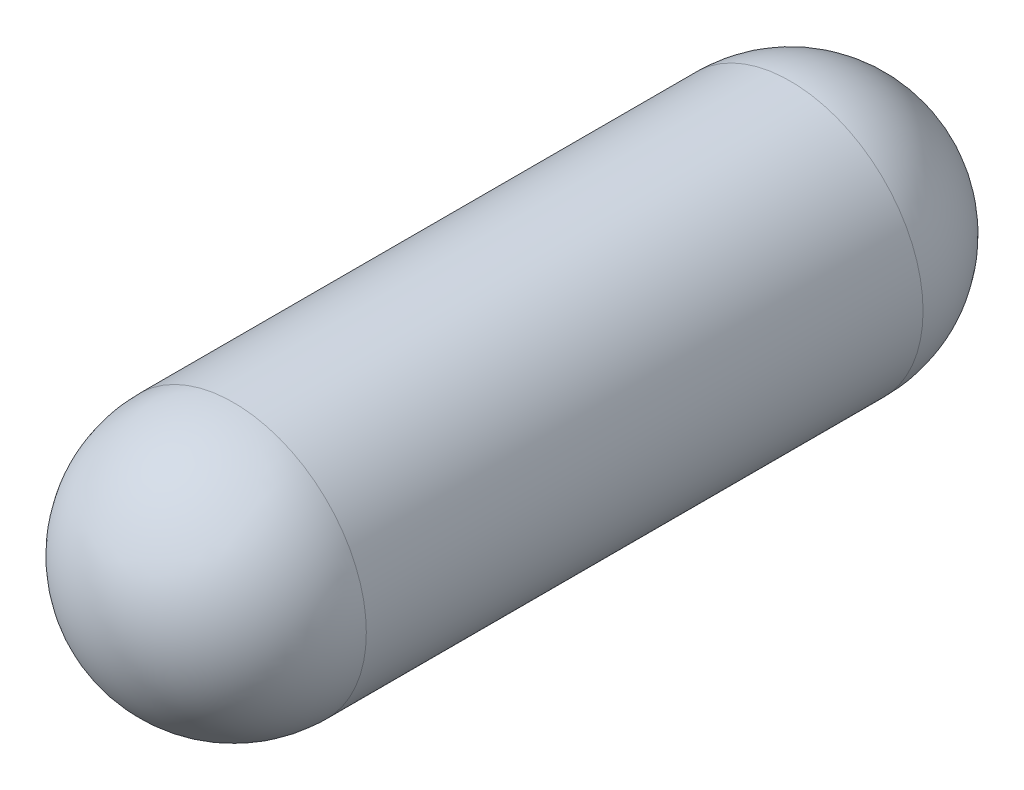
ISO-10303-21;
HEADER;
FILE_DESCRIPTION(('STEP AP214'),'2;1');
FILE_NAME('part.step','',(''),(''),'','','');
FILE_SCHEMA(('AUTOMOTIVE_DESIGN { 1 0 10303 214 1 1 1 1 }'));
ENDSEC;
DATA;
#1=APPLICATION_CONTEXT('core data for automotive mechanical design processes');
#2=APPLICATION_PROTOCOL_DEFINITION('international standard','automotive_design',2000,#1);
#3=PRODUCT_CONTEXT('',#1,'mechanical');
#4=PRODUCT('Part','Part','',(#3));
#5=PRODUCT_RELATED_PRODUCT_CATEGORY('part','',(#4));
#6=PRODUCT_DEFINITION_FORMATION('','',#4);
#7=PRODUCT_DEFINITION_CONTEXT('part definition',#1,'design');
#8=PRODUCT_DEFINITION('design','',#6,#7);
#9=PRODUCT_DEFINITION_SHAPE('','',#8);
#10=(LENGTH_UNIT() NAMED_UNIT(*) SI_UNIT(.MILLI.,.METRE.));
#11=(NAMED_UNIT(*) PLANE_ANGLE_UNIT() SI_UNIT($,.RADIAN.));
#12=(NAMED_UNIT(*) SI_UNIT($,.STERADIAN.) SOLID_ANGLE_UNIT());
#13=UNCERTAINTY_MEASURE_WITH_UNIT(LENGTH_MEASURE(1.E-05),#10,'distance_accuracy_value','');
#14=(GEOMETRIC_REPRESENTATION_CONTEXT(3) GLOBAL_UNCERTAINTY_ASSIGNED_CONTEXT((#13)) GLOBAL_UNIT_ASSIGNED_CONTEXT((#10,
#11,#12)) REPRESENTATION_CONTEXT('',''));
#15=CARTESIAN_POINT('',(0.,0.,0.));
#16=DIRECTION('',(0.,0.,1.));
#17=DIRECTION('',(1.,0.,0.));
#18=AXIS2_PLACEMENT_3D('',#15,#16,#17);
#19=CARTESIAN_POINT('',(0.,0.,-3.));
#20=DIRECTION('',(1.,0.,0.));
#21=DIRECTION('',(0.,-1.,0.));
#22=AXIS2_PLACEMENT_3D('',#19,#20,#21);
#23=SPHERICAL_SURFACE('',#22,1.55);
#24=CARTESIAN_POINT('',(0.,0.,-3.));
#25=DIRECTION('',(0.,0.,1.));
#26=DIRECTION('',(1.,0.,0.));
#27=AXIS2_PLACEMENT_3D('',#24,#25,#26);
#28=CIRCLE('',#27,1.55);
#29=CARTESIAN_POINT('',(1.55,0.,-3.));
#30=VERTEX_POINT('',#29);
#31=CARTESIAN_POINT('',(-1.55,0.,-3.));
#32=VERTEX_POINT('',#31);
#33=EDGE_CURVE('E41',#30,#32,#28,.T.);
#34=ORIENTED_EDGE('',*,*,#33,.F.);
#35=CARTESIAN_POINT('',(0.,0.,-3.));
#36=DIRECTION('',(0.,0.,1.));
#37=DIRECTION('',(1.,0.,0.));
#38=AXIS2_PLACEMENT_3D('',#35,#36,#37);
#39=CIRCLE('',#38,1.55);
#40=EDGE_CURVE('E25',#32,#30,#39,.T.);
#41=ORIENTED_EDGE('',*,*,#40,.F.);
#42=EDGE_LOOP('',(#34,#41));
#43=FACE_BOUND('',#42,.T.);
#44=ADVANCED_FACE('F16',(#43),#23,.T.);
#45=CARTESIAN_POINT('',(0.,0.,3.5));
#46=DIRECTION('',(1.,0.,0.));
#47=DIRECTION('',(0.,1.,0.));
#48=AXIS2_PLACEMENT_3D('',#45,#46,#47);
#49=SPHERICAL_SURFACE('',#48,1.55);
#50=CARTESIAN_POINT('',(0.,0.,3.5));
#51=DIRECTION('',(0.,0.,1.));
#52=DIRECTION('',(1.,0.,0.));
#53=AXIS2_PLACEMENT_3D('',#50,#51,#52);
#54=CIRCLE('',#53,1.55);
#55=CARTESIAN_POINT('',(1.55,0.,3.5));
#56=VERTEX_POINT('',#55);
#57=CARTESIAN_POINT('',(-1.55,0.,3.5));
#58=VERTEX_POINT('',#57);
#59=EDGE_CURVE('E10',#56,#58,#54,.F.);
#60=ORIENTED_EDGE('',*,*,#59,.F.);
#61=CARTESIAN_POINT('',(0.,0.,3.5));
#62=DIRECTION('',(0.,0.,1.));
#63=DIRECTION('',(1.,0.,0.));
#64=AXIS2_PLACEMENT_3D('',#61,#62,#63);
#65=CIRCLE('',#64,1.55);
#66=EDGE_CURVE('E33',#58,#56,#65,.F.);
#67=ORIENTED_EDGE('',*,*,#66,.F.);
#68=EDGE_LOOP('',(#60,#67));
#69=FACE_BOUND('',#68,.T.);
#70=ADVANCED_FACE('F48',(#69),#49,.T.);
#71=CARTESIAN_POINT('',(0.,0.,-3.));
#72=DIRECTION('',(0.,0.,1.));
#73=DIRECTION('',(1.,0.,0.));
#74=AXIS2_PLACEMENT_3D('',#71,#72,#73);
#75=CYLINDRICAL_SURFACE('',#74,1.55);
#76=ORIENTED_EDGE('',*,*,#66,.T.);
#77=ORIENTED_EDGE('',*,*,#59,.T.);
#78=EDGE_LOOP('',(#76,#77));
#79=FACE_BOUND('',#78,.T.);
#80=ORIENTED_EDGE('',*,*,#40,.T.);
#81=ORIENTED_EDGE('',*,*,#33,.T.);
#82=EDGE_LOOP('',(#80,#81));
#83=FACE_BOUND('',#82,.T.);
#84=ADVANCED_FACE('F44',(#79,#83),#75,.T.);
#85=CLOSED_SHELL('',(#44,#70,#84));
#86=MANIFOLD_SOLID_BREP('B1',#85);
#87=ADVANCED_BREP_SHAPE_REPRESENTATION('',(#18,#86),#14);
#88=SHAPE_DEFINITION_REPRESENTATION(#9,#87);
ENDSEC;
END-ISO-10303-21;
